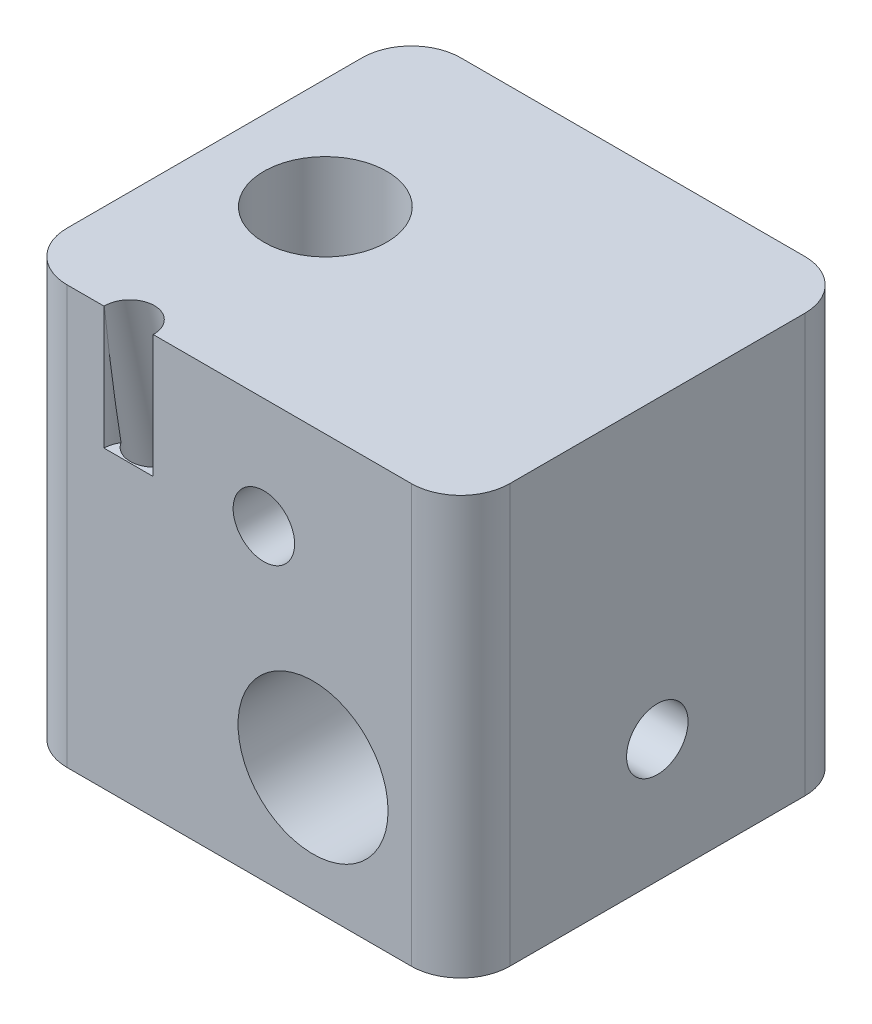
ISO-10303-21;
HEADER;
FILE_DESCRIPTION(('STEP AP214'),'2;1');
FILE_NAME('part.step','',(''),(''),'','','');
FILE_SCHEMA(('AUTOMOTIVE_DESIGN { 1 0 10303 214 1 1 1 1 }'));
ENDSEC;
DATA;
#1=APPLICATION_CONTEXT('core data for automotive mechanical design processes');
#2=APPLICATION_PROTOCOL_DEFINITION('international standard','automotive_design',2000,#1);
#3=PRODUCT_CONTEXT('',#1,'mechanical');
#4=PRODUCT('Part','Part','',(#3));
#5=PRODUCT_RELATED_PRODUCT_CATEGORY('part','',(#4));
#6=PRODUCT_DEFINITION_FORMATION('','',#4);
#7=PRODUCT_DEFINITION_CONTEXT('part definition',#1,'design');
#8=PRODUCT_DEFINITION('design','',#6,#7);
#9=PRODUCT_DEFINITION_SHAPE('','',#8);
#10=(LENGTH_UNIT() NAMED_UNIT(*) SI_UNIT(.MILLI.,.METRE.));
#11=(NAMED_UNIT(*) PLANE_ANGLE_UNIT() SI_UNIT($,.RADIAN.));
#12=(NAMED_UNIT(*) SI_UNIT($,.STERADIAN.) SOLID_ANGLE_UNIT());
#13=UNCERTAINTY_MEASURE_WITH_UNIT(LENGTH_MEASURE(1.E-05),#10,'distance_accuracy_value','');
#14=(GEOMETRIC_REPRESENTATION_CONTEXT(3) GLOBAL_UNCERTAINTY_ASSIGNED_CONTEXT((#13)) GLOBAL_UNIT_ASSIGNED_CONTEXT((#10,
#11,#12)) REPRESENTATION_CONTEXT('',''));
#15=CARTESIAN_POINT('',(0.,0.,0.));
#16=DIRECTION('',(0.,0.,1.));
#17=DIRECTION('',(1.,0.,0.));
#18=AXIS2_PLACEMENT_3D('',#15,#16,#17);
#19=CARTESIAN_POINT('',(-4.5,12.,8.));
#20=DIRECTION('',(0.,1.,0.));
#21=DIRECTION('',(0.,0.,1.));
#22=AXIS2_PLACEMENT_3D('',#19,#20,#21);
#23=CYLINDRICAL_SURFACE('',#22,1.);
#24=CARTESIAN_POINT('',(-4.5,17.,8.));
#25=DIRECTION('',(0.,1.,0.));
#26=DIRECTION('',(0.,0.,1.));
#27=AXIS2_PLACEMENT_3D('',#24,#25,#26);
#28=CIRCLE('',#27,1.);
#29=CARTESIAN_POINT('',(-3.5,17.,8.));
#30=VERTEX_POINT('',#29);
#31=CARTESIAN_POINT('',(-3.5000546384073,17.,7.98954658766438));
#32=VERTEX_POINT('',#31);
#33=EDGE_CURVE('E180',#30,#32,#28,.T.);
#34=ORIENTED_EDGE('',*,*,#33,.T.);
#35=CARTESIAN_POINT('',(-4.5,17.099457574649,8.00000000000001));
#36=DIRECTION('',(0.,0.104528463267653,-0.994521895368273));
#37=DIRECTION('',(0.,0.994521895368273,0.104528463267654));
#38=AXIS2_PLACEMENT_3D('',#35,#36,#37);
#39=ELLIPSE('',#38,9.56677223350565,1.);
#40=CARTESIAN_POINT('',(-3.65576588536236,12.,7.46402541134677));
#41=VERTEX_POINT('',#40);
#42=EDGE_CURVE('E11',#32,#41,#39,.T.);
#43=ORIENTED_EDGE('',*,*,#42,.T.);
#44=CARTESIAN_POINT('',(-4.5,12.,8.));
#45=DIRECTION('',(0.,1.,0.));
#46=DIRECTION('',(0.,0.,1.));
#47=AXIS2_PLACEMENT_3D('',#44,#45,#46);
#48=CIRCLE('',#47,1.);
#49=CARTESIAN_POINT('',(-3.5,12.,8.));
#50=VERTEX_POINT('',#49);
#51=EDGE_CURVE('E179',#50,#41,#48,.T.);
#52=ORIENTED_EDGE('',*,*,#51,.F.);
#53=DIRECTION('',(0.,1.,0.));
#54=VECTOR('',#53,1.);
#55=CARTESIAN_POINT('',(-3.5,12.,8.));
#56=LINE('',#55,#54);
#57=EDGE_CURVE('E69',#30,#50,#56,.F.);
#58=ORIENTED_EDGE('',*,*,#57,.F.);
#59=EDGE_LOOP('',(#34,#43,#52,#58));
#60=FACE_BOUND('',#59,.T.);
#61=ADVANCED_FACE('F41',(#60),#23,.F.);
#62=CARTESIAN_POINT('',(7.,0.,-6.));
#63=DIRECTION('',(0.,-1.,0.));
#64=DIRECTION('',(0.,0.,-1.));
#65=AXIS2_PLACEMENT_3D('',#62,#63,#64);
#66=PLANE('',#65);
#67=CARTESIAN_POINT('',(7.,0.,-6.));
#68=DIRECTION('',(0.,1.,0.));
#69=DIRECTION('',(0.,0.,-1.));
#70=AXIS2_PLACEMENT_3D('',#67,#68,#69);
#71=CIRCLE('',#70,2.);
#72=CARTESIAN_POINT('',(9.,0.,-5.99999999999998));
#73=VERTEX_POINT('',#72);
#74=CARTESIAN_POINT('',(6.99999999999998,0.,-8.));
#75=VERTEX_POINT('',#74);
#76=EDGE_CURVE('E206',#73,#75,#71,.T.);
#77=ORIENTED_EDGE('',*,*,#76,.F.);
#78=DIRECTION('',(0.,0.,-1.));
#79=VECTOR('',#78,1.);
#80=CARTESIAN_POINT('',(9.,0.,-5.99999999999998));
#81=LINE('',#80,#79);
#82=CARTESIAN_POINT('',(9.,0.,5.99999999999999));
#83=VERTEX_POINT('',#82);
#84=EDGE_CURVE('E213',#83,#73,#81,.T.);
#85=ORIENTED_EDGE('',*,*,#84,.F.);
#86=CARTESIAN_POINT('',(7.,0.,6.));
#87=DIRECTION('',(0.,1.,0.));
#88=DIRECTION('',(0.,0.,1.));
#89=AXIS2_PLACEMENT_3D('',#86,#87,#88);
#90=CIRCLE('',#89,2.);
#91=CARTESIAN_POINT('',(6.99999999999999,0.,8.));
#92=VERTEX_POINT('',#91);
#93=EDGE_CURVE('E242',#92,#83,#90,.T.);
#94=ORIENTED_EDGE('',*,*,#93,.F.);
#95=DIRECTION('',(1.,0.,0.));
#96=VECTOR('',#95,1.);
#97=CARTESIAN_POINT('',(-6.99999999999999,0.,8.));
#98=LINE('',#97,#96);
#99=CARTESIAN_POINT('',(-6.99999999999999,0.,8.));
#100=VERTEX_POINT('',#99);
#101=EDGE_CURVE('E240',#100,#92,#98,.T.);
#102=ORIENTED_EDGE('',*,*,#101,.F.);
#103=CARTESIAN_POINT('',(-7.,0.,6.));
#104=DIRECTION('',(0.,1.,0.));
#105=DIRECTION('',(0.,0.,1.));
#106=AXIS2_PLACEMENT_3D('',#103,#104,#105);
#107=CIRCLE('',#106,2.);
#108=CARTESIAN_POINT('',(-9.,0.,5.99999999999999));
#109=VERTEX_POINT('',#108);
#110=EDGE_CURVE('E238',#109,#100,#107,.T.);
#111=ORIENTED_EDGE('',*,*,#110,.F.);
#112=DIRECTION('',(0.,0.,1.));
#113=VECTOR('',#112,1.);
#114=CARTESIAN_POINT('',(-9.,0.,-5.99999999999998));
#115=LINE('',#114,#113);
#116=CARTESIAN_POINT('',(-9.,0.,-5.99999999999998));
#117=VERTEX_POINT('',#116);
#118=EDGE_CURVE('E236',#117,#109,#115,.T.);
#119=ORIENTED_EDGE('',*,*,#118,.F.);
#120=CARTESIAN_POINT('',(-7.,0.,-6.));
#121=DIRECTION('',(0.,1.,0.));
#122=DIRECTION('',(0.,0.,1.));
#123=AXIS2_PLACEMENT_3D('',#120,#121,#122);
#124=CIRCLE('',#123,2.);
#125=CARTESIAN_POINT('',(-6.99999999999999,0.,-8.));
#126=VERTEX_POINT('',#125);
#127=EDGE_CURVE('E234',#126,#117,#124,.T.);
#128=ORIENTED_EDGE('',*,*,#127,.F.);
#129=DIRECTION('',(-1.,0.,0.));
#130=VECTOR('',#129,1.);
#131=CARTESIAN_POINT('',(-6.99999999999999,0.,-8.));
#132=LINE('',#131,#130);
#133=EDGE_CURVE('E232',#75,#126,#132,.T.);
#134=ORIENTED_EDGE('',*,*,#133,.F.);
#135=EDGE_LOOP('',(#77,#85,#94,#102,#111,#119,#128,#134));
#136=FACE_BOUND('',#135,.T.);
#137=CARTESIAN_POINT('',(-4.5,0.,0.));
#138=DIRECTION('',(0.,1.,0.));
#139=DIRECTION('',(0.,0.,1.));
#140=AXIS2_PLACEMENT_3D('',#137,#138,#139);
#141=CIRCLE('',#140,2.5);
#142=CARTESIAN_POINT('',(-4.5,0.,2.5));
#143=VERTEX_POINT('',#142);
#144=EDGE_CURVE('E193',#143,#143,#141,.T.);
#145=ORIENTED_EDGE('',*,*,#144,.T.);
#146=EDGE_LOOP('',(#145));
#147=FACE_BOUND('',#146,.T.);
#148=ADVANCED_FACE('F154',(#136,#147),#66,.T.);
#149=CARTESIAN_POINT('',(7.,17.,-6.));
#150=DIRECTION('',(0.,-1.,0.));
#151=DIRECTION('',(0.,0.,-1.));
#152=AXIS2_PLACEMENT_3D('',#149,#150,#151);
#153=CYLINDRICAL_SURFACE('',#152,2.);
#154=ORIENTED_EDGE('',*,*,#76,.T.);
#155=DIRECTION('',(0.,-1.,0.));
#156=VECTOR('',#155,1.);
#157=CARTESIAN_POINT('',(6.99999999999998,17.,-8.));
#158=LINE('',#157,#156);
#159=CARTESIAN_POINT('',(6.99999999999998,17.,-8.));
#160=VERTEX_POINT('',#159);
#161=EDGE_CURVE('E265',#160,#75,#158,.T.);
#162=ORIENTED_EDGE('',*,*,#161,.F.);
#163=CARTESIAN_POINT('',(7.,17.,-6.));
#164=DIRECTION('',(0.,1.,0.));
#165=DIRECTION('',(0.,0.,-1.));
#166=AXIS2_PLACEMENT_3D('',#163,#164,#165);
#167=CIRCLE('',#166,2.);
#168=CARTESIAN_POINT('',(9.,17.,-5.99999999999998));
#169=VERTEX_POINT('',#168);
#170=EDGE_CURVE('E209',#169,#160,#167,.T.);
#171=ORIENTED_EDGE('',*,*,#170,.F.);
#172=DIRECTION('',(0.,-1.,0.));
#173=VECTOR('',#172,1.);
#174=CARTESIAN_POINT('',(9.,17.,-5.99999999999998));
#175=LINE('',#174,#173);
#176=EDGE_CURVE('E229',#169,#73,#175,.T.);
#177=ORIENTED_EDGE('',*,*,#176,.T.);
#178=EDGE_LOOP('',(#154,#162,#171,#177));
#179=FACE_BOUND('',#178,.T.);
#180=ADVANCED_FACE('F43',(#179),#153,.T.);
#181=CARTESIAN_POINT('',(-6.99999999999999,17.,-8.));
#182=DIRECTION('',(0.,0.,1.));
#183=DIRECTION('',(1.,0.,0.));
#184=AXIS2_PLACEMENT_3D('',#181,#182,#183);
#185=PLANE('',#184);
#186=CARTESIAN_POINT('',(0.999999999999999,12.5,-8.));
#187=DIRECTION('',(0.,0.,1.));
#188=DIRECTION('',(1.,0.,0.));
#189=AXIS2_PLACEMENT_3D('',#186,#187,#188);
#190=CIRCLE('',#189,1.25);
#191=CARTESIAN_POINT('',(2.25,12.5,-8.));
#192=VERTEX_POINT('',#191);
#193=EDGE_CURVE('E199',#192,#192,#190,.T.);
#194=ORIENTED_EDGE('',*,*,#193,.T.);
#195=EDGE_LOOP('',(#194));
#196=FACE_BOUND('',#195,.T.);
#197=CARTESIAN_POINT('',(3.,5.,-8.));
#198=DIRECTION('',(0.,0.,1.));
#199=DIRECTION('',(1.,0.,0.));
#200=AXIS2_PLACEMENT_3D('',#197,#198,#199);
#201=CIRCLE('',#200,3.05);
#202=CARTESIAN_POINT('',(6.05,5.,-8.));
#203=VERTEX_POINT('',#202);
#204=EDGE_CURVE('E203',#203,#203,#201,.T.);
#205=ORIENTED_EDGE('',*,*,#204,.T.);
#206=EDGE_LOOP('',(#205));
#207=FACE_BOUND('',#206,.T.);
#208=ORIENTED_EDGE('',*,*,#133,.T.);
#209=DIRECTION('',(0.,-1.,0.));
#210=VECTOR('',#209,1.);
#211=CARTESIAN_POINT('',(-6.99999999999999,17.,-8.));
#212=LINE('',#211,#210);
#213=CARTESIAN_POINT('',(-6.99999999999999,17.,-8.));
#214=VERTEX_POINT('',#213);
#215=EDGE_CURVE('E262',#214,#126,#212,.T.);
#216=ORIENTED_EDGE('',*,*,#215,.F.);
#217=DIRECTION('',(-1.,0.,0.));
#218=VECTOR('',#217,1.);
#219=CARTESIAN_POINT('',(-6.99999999999999,17.,-8.));
#220=LINE('',#219,#218);
#221=EDGE_CURVE('E212',#160,#214,#220,.T.);
#222=ORIENTED_EDGE('',*,*,#221,.F.);
#223=ORIENTED_EDGE('',*,*,#161,.T.);
#224=EDGE_LOOP('',(#208,#216,#222,#223));
#225=FACE_BOUND('',#224,.T.);
#226=ADVANCED_FACE('F320',(#196,#207,#225),#185,.F.);
#227=CARTESIAN_POINT('',(-7.,17.,-6.));
#228=DIRECTION('',(0.,-1.,0.));
#229=DIRECTION('',(0.,0.,-1.));
#230=AXIS2_PLACEMENT_3D('',#227,#228,#229);
#231=CYLINDRICAL_SURFACE('',#230,2.);
#232=ORIENTED_EDGE('',*,*,#127,.T.);
#233=DIRECTION('',(0.,-1.,0.));
#234=VECTOR('',#233,1.);
#235=CARTESIAN_POINT('',(-9.,17.,-5.99999999999998));
#236=LINE('',#235,#234);
#237=CARTESIAN_POINT('',(-9.,17.,-5.99999999999998));
#238=VERTEX_POINT('',#237);
#239=EDGE_CURVE('E259',#238,#117,#236,.T.);
#240=ORIENTED_EDGE('',*,*,#239,.F.);
#241=CARTESIAN_POINT('',(-7.,17.,-6.));
#242=DIRECTION('',(0.,1.,0.));
#243=DIRECTION('',(0.,0.,1.));
#244=AXIS2_PLACEMENT_3D('',#241,#242,#243);
#245=CIRCLE('',#244,2.);
#246=EDGE_CURVE('E215',#214,#238,#245,.T.);
#247=ORIENTED_EDGE('',*,*,#246,.F.);
#248=ORIENTED_EDGE('',*,*,#215,.T.);
#249=EDGE_LOOP('',(#232,#240,#247,#248));
#250=FACE_BOUND('',#249,.T.);
#251=ADVANCED_FACE('F317',(#250),#231,.T.);
#252=CARTESIAN_POINT('',(-9.,17.,-5.99999999999998));
#253=DIRECTION('',(1.,0.,0.));
#254=DIRECTION('',(0.,0.,-1.));
#255=AXIS2_PLACEMENT_3D('',#252,#253,#254);
#256=PLANE('',#255);
#257=ORIENTED_EDGE('',*,*,#118,.T.);
#258=DIRECTION('',(0.,-1.,0.));
#259=VECTOR('',#258,1.);
#260=CARTESIAN_POINT('',(-9.,17.,5.99999999999999));
#261=LINE('',#260,#259);
#262=CARTESIAN_POINT('',(-9.,17.,5.99999999999999));
#263=VERTEX_POINT('',#262);
#264=EDGE_CURVE('E256',#263,#109,#261,.T.);
#265=ORIENTED_EDGE('',*,*,#264,.F.);
#266=DIRECTION('',(0.,0.,1.));
#267=VECTOR('',#266,1.);
#268=CARTESIAN_POINT('',(-9.,17.,-5.99999999999998));
#269=LINE('',#268,#267);
#270=EDGE_CURVE('E217',#238,#263,#269,.T.);
#271=ORIENTED_EDGE('',*,*,#270,.F.);
#272=ORIENTED_EDGE('',*,*,#239,.T.);
#273=EDGE_LOOP('',(#257,#265,#271,#272));
#274=FACE_BOUND('',#273,.T.);
#275=ADVANCED_FACE('F309',(#274),#256,.F.);
#276=CARTESIAN_POINT('',(-7.,17.,6.));
#277=DIRECTION('',(0.,-1.,0.));
#278=DIRECTION('',(0.,0.,-1.));
#279=AXIS2_PLACEMENT_3D('',#276,#277,#278);
#280=CYLINDRICAL_SURFACE('',#279,2.);
#281=ORIENTED_EDGE('',*,*,#110,.T.);
#282=DIRECTION('',(0.,-1.,0.));
#283=VECTOR('',#282,1.);
#284=CARTESIAN_POINT('',(-6.99999999999999,17.,8.));
#285=LINE('',#284,#283);
#286=CARTESIAN_POINT('',(-6.99999999999999,17.,8.));
#287=VERTEX_POINT('',#286);
#288=EDGE_CURVE('E253',#287,#100,#285,.T.);
#289=ORIENTED_EDGE('',*,*,#288,.F.);
#290=CARTESIAN_POINT('',(-7.,17.,6.));
#291=DIRECTION('',(0.,1.,0.));
#292=DIRECTION('',(0.,0.,1.));
#293=AXIS2_PLACEMENT_3D('',#290,#291,#292);
#294=CIRCLE('',#293,2.);
#295=EDGE_CURVE('E219',#263,#287,#294,.T.);
#296=ORIENTED_EDGE('',*,*,#295,.F.);
#297=ORIENTED_EDGE('',*,*,#264,.T.);
#298=EDGE_LOOP('',(#281,#289,#296,#297));
#299=FACE_BOUND('',#298,.T.);
#300=ADVANCED_FACE('F299',(#299),#280,.T.);
#301=CARTESIAN_POINT('',(-6.99999999999999,17.,8.));
#302=DIRECTION('',(0.,0.,-1.));
#303=DIRECTION('',(-1.,0.,0.));
#304=AXIS2_PLACEMENT_3D('',#301,#302,#303);
#305=PLANE('',#304);
#306=CARTESIAN_POINT('',(0.999999999999999,12.5,8.00000000000001));
#307=DIRECTION('',(0.,0.,1.));
#308=DIRECTION('',(1.,0.,0.));
#309=AXIS2_PLACEMENT_3D('',#306,#307,#308);
#310=CIRCLE('',#309,1.24999999999999);
#311=CARTESIAN_POINT('',(2.24999999999999,12.5,8.00000000000001));
#312=VERTEX_POINT('',#311);
#313=EDGE_CURVE('E196',#312,#312,#310,.T.);
#314=ORIENTED_EDGE('',*,*,#313,.F.);
#315=EDGE_LOOP('',(#314));
#316=FACE_BOUND('',#315,.T.);
#317=CARTESIAN_POINT('',(3.,5.,8.));
#318=DIRECTION('',(0.,0.,1.));
#319=DIRECTION('',(1.,0.,0.));
#320=AXIS2_PLACEMENT_3D('',#317,#318,#319);
#321=CIRCLE('',#320,3.05);
#322=CARTESIAN_POINT('',(6.05,5.,8.));
#323=VERTEX_POINT('',#322);
#324=EDGE_CURVE('E202',#323,#323,#321,.T.);
#325=ORIENTED_EDGE('',*,*,#324,.F.);
#326=EDGE_LOOP('',(#325));
#327=FACE_BOUND('',#326,.T.);
#328=DIRECTION('',(1.,0.,0.));
#329=VECTOR('',#328,1.);
#330=CARTESIAN_POINT('',(-6.99999999999999,12.,8.));
#331=LINE('',#330,#329);
#332=CARTESIAN_POINT('',(-5.5,12.,8.));
#333=VERTEX_POINT('',#332);
#334=EDGE_CURVE('E268',#333,#50,#331,.T.);
#335=ORIENTED_EDGE('',*,*,#334,.F.);
#336=DIRECTION('',(0.,1.,0.));
#337=VECTOR('',#336,1.);
#338=CARTESIAN_POINT('',(-5.5,12.,8.));
#339=LINE('',#338,#337);
#340=CARTESIAN_POINT('',(-5.5,17.,8.));
#341=VERTEX_POINT('',#340);
#342=EDGE_CURVE('E176',#333,#341,#339,.T.);
#343=ORIENTED_EDGE('',*,*,#342,.T.);
#344=DIRECTION('',(1.,0.,0.));
#345=VECTOR('',#344,1.);
#346=CARTESIAN_POINT('',(-6.99999999999999,17.,8.));
#347=LINE('',#346,#345);
#348=EDGE_CURVE('E222',#287,#341,#347,.T.);
#349=ORIENTED_EDGE('',*,*,#348,.F.);
#350=ORIENTED_EDGE('',*,*,#288,.T.);
#351=ORIENTED_EDGE('',*,*,#101,.T.);
#352=DIRECTION('',(0.,-1.,0.));
#353=VECTOR('',#352,1.);
#354=CARTESIAN_POINT('',(6.99999999999999,17.,8.));
#355=LINE('',#354,#353);
#356=CARTESIAN_POINT('',(6.99999999999999,17.,8.));
#357=VERTEX_POINT('',#356);
#358=EDGE_CURVE('E250',#357,#92,#355,.T.);
#359=ORIENTED_EDGE('',*,*,#358,.F.);
#360=EDGE_CURVE('E221',#30,#357,#347,.T.);
#361=ORIENTED_EDGE('',*,*,#360,.F.);
#362=ORIENTED_EDGE('',*,*,#57,.T.);
#363=EDGE_LOOP('',(#335,#343,#349,#350,#351,#359,#361,#362));
#364=FACE_BOUND('',#363,.T.);
#365=ADVANCED_FACE('F271',(#316,#327,#364),#305,.F.);
#366=CARTESIAN_POINT('',(7.,17.,6.));
#367=DIRECTION('',(0.,-1.,0.));
#368=DIRECTION('',(0.,0.,-1.));
#369=AXIS2_PLACEMENT_3D('',#366,#367,#368);
#370=CYLINDRICAL_SURFACE('',#369,2.);
#371=ORIENTED_EDGE('',*,*,#93,.T.);
#372=DIRECTION('',(0.,-1.,0.));
#373=VECTOR('',#372,1.);
#374=CARTESIAN_POINT('',(9.,17.,5.99999999999999));
#375=LINE('',#374,#373);
#376=CARTESIAN_POINT('',(9.,17.,5.99999999999999));
#377=VERTEX_POINT('',#376);
#378=EDGE_CURVE('E247',#377,#83,#375,.T.);
#379=ORIENTED_EDGE('',*,*,#378,.F.);
#380=CARTESIAN_POINT('',(7.,17.,6.));
#381=DIRECTION('',(0.,1.,0.));
#382=DIRECTION('',(0.,0.,1.));
#383=AXIS2_PLACEMENT_3D('',#380,#381,#382);
#384=CIRCLE('',#383,2.);
#385=EDGE_CURVE('E225',#357,#377,#384,.T.);
#386=ORIENTED_EDGE('',*,*,#385,.F.);
#387=ORIENTED_EDGE('',*,*,#358,.T.);
#388=EDGE_LOOP('',(#371,#379,#386,#387));
#389=FACE_BOUND('',#388,.T.);
#390=ADVANCED_FACE('F298',(#389),#370,.T.);
#391=CARTESIAN_POINT('',(9.,17.,-5.99999999999998));
#392=DIRECTION('',(-1.,0.,0.));
#393=DIRECTION('',(0.,0.,1.));
#394=AXIS2_PLACEMENT_3D('',#391,#392,#393);
#395=PLANE('',#394);
#396=CARTESIAN_POINT('',(9.,5.,0.));
#397=DIRECTION('',(1.,0.,0.));
#398=DIRECTION('',(0.,0.,-1.));
#399=AXIS2_PLACEMENT_3D('',#396,#397,#398);
#400=CIRCLE('',#399,1.25);
#401=CARTESIAN_POINT('',(9.,5.,-1.25));
#402=VERTEX_POINT('',#401);
#403=EDGE_CURVE('E282',#402,#402,#400,.T.);
#404=ORIENTED_EDGE('',*,*,#403,.F.);
#405=EDGE_LOOP('',(#404));
#406=FACE_BOUND('',#405,.T.);
#407=ORIENTED_EDGE('',*,*,#84,.T.);
#408=ORIENTED_EDGE('',*,*,#176,.F.);
#409=DIRECTION('',(0.,0.,-1.));
#410=VECTOR('',#409,1.);
#411=CARTESIAN_POINT('',(9.,17.,-5.99999999999998));
#412=LINE('',#411,#410);
#413=EDGE_CURVE('E227',#377,#169,#412,.T.);
#414=ORIENTED_EDGE('',*,*,#413,.F.);
#415=ORIENTED_EDGE('',*,*,#378,.T.);
#416=EDGE_LOOP('',(#407,#408,#414,#415));
#417=FACE_BOUND('',#416,.T.);
#418=ADVANCED_FACE('F306',(#406,#417),#395,.F.);
#419=CARTESIAN_POINT('',(7.,17.,-6.));
#420=DIRECTION('',(0.,-1.,0.));
#421=DIRECTION('',(0.,0.,-1.));
#422=AXIS2_PLACEMENT_3D('',#419,#420,#421);
#423=PLANE('',#422);
#424=CARTESIAN_POINT('',(-4.5,17.,0.));
#425=DIRECTION('',(0.,1.,0.));
#426=DIRECTION('',(0.,0.,1.));
#427=AXIS2_PLACEMENT_3D('',#424,#425,#426);
#428=CIRCLE('',#427,2.49999999999999);
#429=CARTESIAN_POINT('',(-4.5,17.,2.49999999999999));
#430=VERTEX_POINT('',#429);
#431=EDGE_CURVE('E190',#430,#430,#428,.T.);
#432=ORIENTED_EDGE('',*,*,#431,.F.);
#433=EDGE_LOOP('',(#432));
#434=FACE_BOUND('',#433,.T.);
#435=CARTESIAN_POINT('',(-5.49994536159271,17.,7.98954658767516));
#436=VERTEX_POINT('',#435);
#437=EDGE_CURVE('E183',#436,#341,#28,.T.);
#438=ORIENTED_EDGE('',*,*,#437,.F.);
#439=CARTESIAN_POINT('',(-4.5,17.,7.9788596399006));
#440=DIRECTION('',(0.,-1.,0.));
#441=DIRECTION('',(0.,0.,-1.));
#442=AXIS2_PLACEMENT_3D('',#439,#440,#441);
#443=ELLIPSE('',#442,1.02234059486503,1.);
#444=EDGE_CURVE('E61',#436,#32,#443,.T.);
#445=ORIENTED_EDGE('',*,*,#444,.T.);
#446=ORIENTED_EDGE('',*,*,#33,.F.);
#447=ORIENTED_EDGE('',*,*,#360,.T.);
#448=ORIENTED_EDGE('',*,*,#385,.T.);
#449=ORIENTED_EDGE('',*,*,#413,.T.);
#450=ORIENTED_EDGE('',*,*,#170,.T.);
#451=ORIENTED_EDGE('',*,*,#221,.T.);
#452=ORIENTED_EDGE('',*,*,#246,.T.);
#453=ORIENTED_EDGE('',*,*,#270,.T.);
#454=ORIENTED_EDGE('',*,*,#295,.T.);
#455=ORIENTED_EDGE('',*,*,#348,.T.);
#456=EDGE_LOOP('',(#438,#445,#446,#447,#448,#449,#450,#451,#452,#453,#454,#455));
#457=FACE_BOUND('',#456,.T.);
#458=ADVANCED_FACE('F275',(#434,#457),#423,.F.);
#459=CARTESIAN_POINT('',(3.,5.,-8.));
#460=DIRECTION('',(0.,0.,1.));
#461=DIRECTION('',(1.,0.,0.));
#462=AXIS2_PLACEMENT_3D('',#459,#460,#461);
#463=CYLINDRICAL_SURFACE('',#462,3.05);
#464=CARTESIAN_POINT('',(6.05,5.,-1.25));
#465=CARTESIAN_POINT('',(6.0499949013604,5.06705105449435,-1.24999317358084));
#466=CARTESIAN_POINT('',(6.04776316601173,5.13421220939516,-1.2445728904159));
#467=CARTESIAN_POINT('',(6.03905220749816,5.26663531512961,-1.22308214272691));
#468=CARTESIAN_POINT('',(6.03256170556949,5.33189174087961,-1.2069833965083));
#469=CARTESIAN_POINT('',(6.01603149034563,5.45837429284752,-1.16482596800736));
#470=CARTESIAN_POINT('',(6.00600364451594,5.5196130929358,-1.13880056530878));
#471=CARTESIAN_POINT('',(5.98337979201622,5.63679775394015,-1.07766372514542));
#472=CARTESIAN_POINT('',(5.97078461030852,5.69274530666015,-1.04255520538644));
#473=CARTESIAN_POINT('',(5.94360272183732,5.80058268229026,-0.962433598338683));
#474=CARTESIAN_POINT('',(5.92895218720805,5.85217961883631,-0.917048137846257));
#475=CARTESIAN_POINT('',(5.8995935820288,5.94727980579278,-0.818447693953155));
#476=CARTESIAN_POINT('',(5.88488548598071,5.99077892161813,-0.765228735620994));
#477=CARTESIAN_POINT('',(5.85630174305004,6.07047635819199,-0.64942208796871));
#478=CARTESIAN_POINT('',(5.84249824263372,6.10623272255294,-0.586510586657886));
#479=CARTESIAN_POINT('',(5.81829427065234,6.16652509902148,-0.454917226841783));
#480=CARTESIAN_POINT('',(5.80789210323985,6.1910667050528,-0.386238265428793));
#481=CARTESIAN_POINT('',(5.79235707938261,6.227033698322,-0.248428842832731));
#482=CARTESIAN_POINT('',(5.78699943260883,6.23902161527503,-0.179471492843172));
#483=CARTESIAN_POINT('',(5.78151145539133,6.25129693566521,-0.0403318756690747));
#484=CARTESIAN_POINT('',(5.78137837438494,6.25159049579919,0.0298497275147819));
#485=CARTESIAN_POINT('',(5.78616368996563,6.24089353762405,0.163925901590137));
#486=CARTESIAN_POINT('',(5.79071047916049,6.23073314256809,0.227902592734092));
#487=CARTESIAN_POINT('',(5.80371701324257,6.20080567936669,0.353147282962071));
#488=CARTESIAN_POINT('',(5.81217747930137,6.18103684064336,0.41441478054353));
#489=CARTESIAN_POINT('',(5.83224715740188,6.13207159424285,0.534021432652645));
#490=CARTESIAN_POINT('',(5.84391858333761,6.10268647565431,0.592272424650275));
#491=CARTESIAN_POINT('',(5.8690795378448,6.03545581744839,0.703238106802874));
#492=CARTESIAN_POINT('',(5.88256976900066,5.9976070046597,0.755950643442822));
#493=CARTESIAN_POINT('',(5.91118669367845,5.91089979031178,0.858864937284251));
#494=CARTESIAN_POINT('',(5.92635714795841,5.86139546177047,0.908511828807874));
#495=CARTESIAN_POINT('',(5.95569448523891,5.75460843164101,0.998981661817663));
#496=CARTESIAN_POINT('',(5.96986114763167,5.69732402821036,1.03980266761885));
#497=CARTESIAN_POINT('',(5.9959821432301,5.57496342854658,1.11223980523006));
#498=CARTESIAN_POINT('',(6.00788187819974,5.50974527572703,1.14363728064276));
#499=CARTESIAN_POINT('',(6.02771185130719,5.37434088842294,1.19482196887003));
#500=CARTESIAN_POINT('',(6.0356442094366,5.30415733016857,1.21461538335976));
#501=CARTESIAN_POINT('',(6.04625363825052,5.16545720041041,1.24088500214244));
#502=CARTESIAN_POINT('',(6.04922426910946,5.09710415103709,1.24810627215568));
#503=CARTESIAN_POINT('',(6.0505074612745,4.96010441371817,1.25123907850245));
#504=CARTESIAN_POINT('',(6.04882130524732,4.89145781182913,1.24715372913384));
#505=CARTESIAN_POINT('',(6.04117156509262,4.75926209998629,1.22832878266846));
#506=CARTESIAN_POINT('',(6.03541570476584,4.69562598291882,1.21410632521057));
#507=CARTESIAN_POINT('',(6.02042451329165,4.57170816248345,1.17612394528366));
#508=CARTESIAN_POINT('',(6.01118873925112,4.51142688721188,1.15236280878941));
#509=CARTESIAN_POINT('',(5.98977295322551,4.39383011012163,1.09520071595727));
#510=CARTESIAN_POINT('',(5.97751077732146,4.33666382302296,1.06152455804877));
#511=CARTESIAN_POINT('',(5.95135965585715,4.22859041874229,0.985791883606979));
#512=CARTESIAN_POINT('',(5.93747004246777,4.17768588879936,0.943731921728038));
#513=CARTESIAN_POINT('',(5.9083776173988,4.07987991098666,0.84901559600058));
#514=CARTESIAN_POINT('',(5.89315046142814,4.03349954211682,0.795827240559546));
#515=CARTESIAN_POINT('',(5.86397295744692,3.95018452435906,0.682168042389588));
#516=CARTESIAN_POINT('',(5.85002286554325,3.91325176747518,0.621695744519813));
#517=CARTESIAN_POINT('',(5.82491824303052,3.84955272757804,0.49408064279938));
#518=CARTESIAN_POINT('',(5.8138001745101,3.82291696039833,0.426864996442403));
#519=CARTESIAN_POINT('',(5.79614362783962,3.78156002386075,0.288305958715392));
#520=CARTESIAN_POINT('',(5.78960153937764,3.7668294602223,0.216965869632516));
#521=CARTESIAN_POINT('',(5.78237686582237,3.75061997017984,0.0779442828042265));
#522=CARTESIAN_POINT('',(5.78129189039513,3.74823064874134,0.010389284598139));
#523=CARTESIAN_POINT('',(5.78404131006805,3.75435741732201,-0.124115415101153));
#524=CARTESIAN_POINT('',(5.78787500688879,3.76287195937366,-0.191065201154603));
#525=CARTESIAN_POINT('',(5.79966724973413,3.78980857539514,-0.319459584533195));
#526=CARTESIAN_POINT('',(5.80743875303861,3.80778270632241,-0.38101694579431));
#527=CARTESIAN_POINT('',(5.82609039777681,3.85269826055876,-0.500260930445375));
#528=CARTESIAN_POINT('',(5.83697140660187,3.87964218632338,-0.557946468244503));
#529=CARTESIAN_POINT('',(5.86141244323642,3.94356546820025,-0.671520528671244));
#530=CARTESIAN_POINT('',(5.87509264152987,3.9810430499474,-0.727102315583994));
#531=CARTESIAN_POINT('',(5.90324259102355,4.06425954659735,-0.831473336340558));
#532=CARTESIAN_POINT('',(5.91771260035406,4.11000117381969,-0.880260330746794));
#533=CARTESIAN_POINT('',(5.94701985281455,4.21222488066987,-0.973140820244658));
#534=CARTESIAN_POINT('',(5.961812751821,4.2692324065468,-1.01667265144534));
#535=CARTESIAN_POINT('',(5.98908126299053,4.39029737005191,-1.09357367951556));
#536=CARTESIAN_POINT('',(6.00155581115557,4.45435802331352,-1.12693821461591));
#537=CARTESIAN_POINT('',(6.02258806460315,4.58663629870452,-1.18180811191665));
#538=CARTESIAN_POINT('',(6.03121040731175,4.65476171520484,-1.20351052450805));
#539=CARTESIAN_POINT('',(6.04383134859934,4.79399616753341,-1.23495872650017));
#540=CARTESIAN_POINT('',(6.04784450441534,4.86509507070934,-1.24474216568277));
#541=CARTESIAN_POINT('',(6.04978053015449,4.95760124338892,-1.24946289651355));
#542=CARTESIAN_POINT('',(6.05000161244387,4.97879511590617,-1.25000215885385));
#543=CARTESIAN_POINT('',(6.05,5.,-1.25));
#544=B_SPLINE_CURVE_WITH_KNOTS('',3,(#464,#465,#466,#467,#468,#469,#470,#471,#472,#473,#474,
#475,#476,#477,#478,#479,#480,#481,#482,#483,#484,#485,#486,#487,#488,#489,#490,#491,#492,#493,
#494,#495,#496,#497,#498,#499,#500,#501,#502,#503,#504,#505,#506,#507,#508,#509,#510,#511,#512,
#513,#514,#515,#516,#517,#518,#519,#520,#521,#522,#523,#524,#525,#526,#527,#528,#529,#530,#531,
#532,#533,#534,#535,#536,#537,#538,#539,#540,#541,#542,#543),.UNSPECIFIED.,.T.,.F.,(4,2,2,2,2,2,
2,2,2,2,2,2,2,2,2,2,2,2,2,2,2,2,2,2,2,2,2,2,2,2,2,2,2,2,2,2,2,2,2,4),(0.,0.201094311180327,
0.402723354574275,0.603682285542811,0.804576743863709,1.01444492091329,1.22441996030868,
1.4443140997696,1.66409843594336,1.87354721803841,2.08288573073389,2.27679448285736,
2.47073898070665,2.66874390795883,2.86682554265504,3.08105274490333,3.29532688370777,
3.51424468844057,3.73304538781655,3.93837132545349,4.14364071369573,4.33912550528583,
4.53463518488673,4.73618655641971,4.93782092740472,5.15341391236425,5.36905003881044,
5.58733616568888,5.80544987646515,6.00721727204664,6.20895602688516,6.40190297186303,
6.59490379169178,6.79928960640033,7.0037426242785,7.22240178249369,7.44116104698126,
7.65609749208751,7.87035321839585,7.93394925864705),.UNSPECIFIED.);
#545=CARTESIAN_POINT('',(6.05,5.,-1.25));
#546=VERTEX_POINT('',#545);
#547=EDGE_CURVE('E45',#546,#546,#544,.T.);
#548=ORIENTED_EDGE('',*,*,#547,.T.);
#549=EDGE_LOOP('',(#548));
#550=FACE_BOUND('',#549,.T.);
#551=ORIENTED_EDGE('',*,*,#204,.F.);
#552=EDGE_LOOP('',(#551));
#553=FACE_BOUND('',#552,.T.);
#554=ORIENTED_EDGE('',*,*,#324,.T.);
#555=EDGE_LOOP('',(#554));
#556=FACE_BOUND('',#555,.T.);
#557=ADVANCED_FACE('F288',(#550,#553,#556),#463,.F.);
#558=CARTESIAN_POINT('',(0.999999999999999,12.5,8.));
#559=DIRECTION('',(0.,0.,1.));
#560=DIRECTION('',(1.,0.,0.));
#561=AXIS2_PLACEMENT_3D('',#558,#559,#560);
#562=CYLINDRICAL_SURFACE('',#561,1.24999999999999);
#563=ORIENTED_EDGE('',*,*,#193,.F.);
#564=EDGE_LOOP('',(#563));
#565=FACE_BOUND('',#564,.T.);
#566=ORIENTED_EDGE('',*,*,#313,.T.);
#567=EDGE_LOOP('',(#566));
#568=FACE_BOUND('',#567,.T.);
#569=ADVANCED_FACE('F292',(#565,#568),#562,.F.);
#570=CARTESIAN_POINT('',(-4.5,17.,0.));
#571=DIRECTION('',(0.,1.,0.));
#572=DIRECTION('',(0.,0.,1.));
#573=AXIS2_PLACEMENT_3D('',#570,#571,#572);
#574=CYLINDRICAL_SURFACE('',#573,2.49999999999999);
#575=ORIENTED_EDGE('',*,*,#144,.F.);
#576=EDGE_LOOP('',(#575));
#577=FACE_BOUND('',#576,.T.);
#578=ORIENTED_EDGE('',*,*,#431,.T.);
#579=EDGE_LOOP('',(#578));
#580=FACE_BOUND('',#579,.T.);
#581=ADVANCED_FACE('F169',(#577,#580),#574,.F.);
#582=CARTESIAN_POINT('',(-4.5,12.,8.));
#583=DIRECTION('',(0.,1.,0.));
#584=DIRECTION('',(0.,0.,1.));
#585=AXIS2_PLACEMENT_3D('',#582,#583,#584);
#586=PLANE('',#585);
#587=CARTESIAN_POINT('',(-4.5,12.,6.91607683155049));
#588=DIRECTION('',(0.,1.,0.));
#589=DIRECTION('',(0.,0.,-1.));
#590=AXIS2_PLACEMENT_3D('',#587,#588,#589);
#591=ELLIPSE('',#590,1.02234059486503,1.);
#592=CARTESIAN_POINT('',(-5.34423411463764,12.,7.46402541134677));
#593=VERTEX_POINT('',#592);
#594=EDGE_CURVE('E277',#593,#41,#591,.T.);
#595=ORIENTED_EDGE('',*,*,#594,.F.);
#596=EDGE_CURVE('E173',#593,#333,#48,.T.);
#597=ORIENTED_EDGE('',*,*,#596,.T.);
#598=ORIENTED_EDGE('',*,*,#334,.T.);
#599=ORIENTED_EDGE('',*,*,#51,.T.);
#600=EDGE_LOOP('',(#595,#597,#598,#599));
#601=FACE_BOUND('',#600,.T.);
#602=ADVANCED_FACE('F164',(#601),#586,.T.);
#603=ORIENTED_EDGE('',*,*,#596,.F.);
#604=EDGE_CURVE('E54',#593,#436,#39,.T.);
#605=ORIENTED_EDGE('',*,*,#604,.T.);
#606=ORIENTED_EDGE('',*,*,#437,.T.);
#607=ORIENTED_EDGE('',*,*,#342,.F.);
#608=EDGE_LOOP('',(#603,#605,#606,#607));
#609=FACE_BOUND('',#608,.T.);
#610=ADVANCED_FACE('F149',(#609),#23,.F.);
#611=CARTESIAN_POINT('',(-4.5,1.13265938453962,4.60615227583124));
#612=DIRECTION('',(0.,-0.978147600733806,-0.20791169081776));
#613=DIRECTION('',(0.,0.20791169081776,-0.978147600733806));
#614=AXIS2_PLACEMENT_3D('',#611,#612,#613);
#615=CYLINDRICAL_SURFACE('',#614,1.);
#616=CARTESIAN_POINT('',(-4.5,2.61791169081776,4.9218523992662));
#617=DIRECTION('',(0.,-0.978147600733806,-0.20791169081776));
#618=DIRECTION('',(0.,0.20791169081776,-0.978147600733806));
#619=AXIS2_PLACEMENT_3D('',#616,#617,#618);
#620=CIRCLE('',#619,1.);
#621=CARTESIAN_POINT('',(-4.5,2.82582338163552,3.94370479853239));
#622=VERTEX_POINT('',#621);
#623=EDGE_CURVE('E278',#622,#622,#620,.T.);
#624=ORIENTED_EDGE('',*,*,#623,.T.);
#625=EDGE_LOOP('',(#624));
#626=FACE_BOUND('',#625,.T.);
#627=ORIENTED_EDGE('',*,*,#444,.F.);
#628=ORIENTED_EDGE('',*,*,#604,.F.);
#629=ORIENTED_EDGE('',*,*,#594,.T.);
#630=ORIENTED_EDGE('',*,*,#42,.F.);
#631=EDGE_LOOP('',(#627,#628,#629,#630));
#632=FACE_BOUND('',#631,.T.);
#633=ADVANCED_FACE('F141',(#626,#632),#615,.F.);
#634=CARTESIAN_POINT('',(-4.5,2.03018131794052,4.79692645201837));
#635=DIRECTION('',(0.,0.978147600733806,0.20791169081776));
#636=DIRECTION('',(0.,-0.20791169081776,0.978147600733806));
#637=AXIS2_PLACEMENT_3D('',#634,#635,#636);
#638=CONICAL_SURFACE('',#637,0.,1.02974425867665);
#639=ORIENTED_EDGE('',*,*,#623,.F.);
#640=EDGE_LOOP('',(#639));
#641=FACE_BOUND('',#640,.T.);
#642=CARTESIAN_POINT('',(-4.5,2.03018131794052,4.79692645201837));
#643=VERTEX_POINT('',#642);
#644=VERTEX_LOOP('',#643);
#645=FACE_BOUND('',#644,.T.);
#646=ADVANCED_FACE('F138',(#641,#645),#638,.F.);
#647=CARTESIAN_POINT('',(9.,5.,0.));
#648=DIRECTION('',(1.,0.,0.));
#649=DIRECTION('',(0.,0.,-1.));
#650=AXIS2_PLACEMENT_3D('',#647,#648,#649);
#651=CYLINDRICAL_SURFACE('',#650,1.25);
#652=ORIENTED_EDGE('',*,*,#403,.T.);
#653=EDGE_LOOP('',(#652));
#654=FACE_BOUND('',#653,.T.);
#655=ORIENTED_EDGE('',*,*,#547,.F.);
#656=EDGE_LOOP('',(#655));
#657=FACE_BOUND('',#656,.T.);
#658=ADVANCED_FACE('F140',(#654,#657),#651,.F.);
#659=CLOSED_SHELL('',(#61,#148,#180,#226,#251,#275,#300,#365,#390,#418,#458,#557,#569,#581,#602,
#610,#633,#646,#658));
#660=MANIFOLD_SOLID_BREP('B2',#659);
#661=ADVANCED_BREP_SHAPE_REPRESENTATION('',(#18,#660),#14);
#662=SHAPE_DEFINITION_REPRESENTATION(#9,#661);
ENDSEC;
END-ISO-10303-21;
